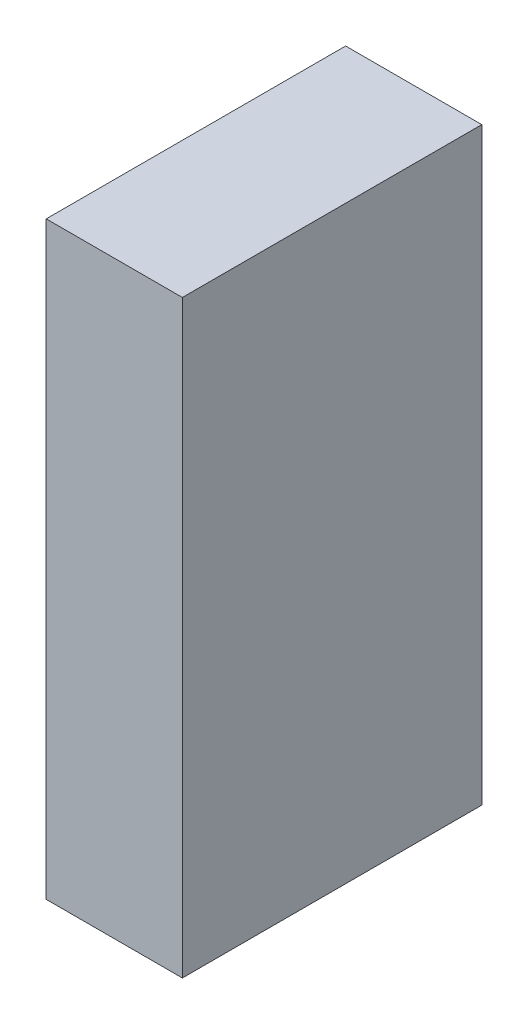
ISO-10303-21;
HEADER;
FILE_DESCRIPTION(('STEP AP214'),'2;1');
FILE_NAME('part.step','',(''),(''),'','','');
FILE_SCHEMA(('AUTOMOTIVE_DESIGN { 1 0 10303 214 1 1 1 1 }'));
ENDSEC;
DATA;
#1=APPLICATION_CONTEXT('core data for automotive mechanical design processes');
#2=APPLICATION_PROTOCOL_DEFINITION('international standard','automotive_design',2000,#1);
#3=PRODUCT_CONTEXT('',#1,'mechanical');
#4=PRODUCT('Part','Part','',(#3));
#5=PRODUCT_RELATED_PRODUCT_CATEGORY('part','',(#4));
#6=PRODUCT_DEFINITION_FORMATION('','',#4);
#7=PRODUCT_DEFINITION_CONTEXT('part definition',#1,'design');
#8=PRODUCT_DEFINITION('design','',#6,#7);
#9=PRODUCT_DEFINITION_SHAPE('','',#8);
#10=(LENGTH_UNIT() NAMED_UNIT(*) SI_UNIT(.MILLI.,.METRE.));
#11=(NAMED_UNIT(*) PLANE_ANGLE_UNIT() SI_UNIT($,.RADIAN.));
#12=(NAMED_UNIT(*) SI_UNIT($,.STERADIAN.) SOLID_ANGLE_UNIT());
#13=UNCERTAINTY_MEASURE_WITH_UNIT(LENGTH_MEASURE(1.E-05),#10,'distance_accuracy_value','');
#14=(GEOMETRIC_REPRESENTATION_CONTEXT(3) GLOBAL_UNCERTAINTY_ASSIGNED_CONTEXT((#13)) GLOBAL_UNIT_ASSIGNED_CONTEXT((#10,
#11,#12)) REPRESENTATION_CONTEXT('',''));
#15=CARTESIAN_POINT('',(0.,0.,0.));
#16=DIRECTION('',(0.,0.,1.));
#17=DIRECTION('',(1.,0.,0.));
#18=AXIS2_PLACEMENT_3D('',#15,#16,#17);
#19=CARTESIAN_POINT('',(-0.11549888,-0.499999,0.508));
#20=DIRECTION('',(0.,0.,1.));
#21=DIRECTION('',(1.,0.,0.));
#22=AXIS2_PLACEMENT_3D('',#19,#20,#21);
#23=PLANE('',#22);
#24=DIRECTION('',(0.,1.,0.));
#25=VECTOR('',#24,1.);
#26=CARTESIAN_POINT('',(-0.11549888,-0.499999,0.508));
#27=LINE('',#26,#25);
#28=CARTESIAN_POINT('',(-0.11549888,-0.499999,0.508));
#29=VERTEX_POINT('',#28);
#30=CARTESIAN_POINT('',(-0.11549888,0.499999,0.508));
#31=VERTEX_POINT('',#30);
#32=EDGE_CURVE('E103',#29,#31,#27,.T.);
#33=ORIENTED_EDGE('',*,*,#32,.F.);
#34=DIRECTION('',(-1.,0.,0.));
#35=VECTOR('',#34,1.);
#36=CARTESIAN_POINT('',(0.11550142,-0.499999,0.508));
#37=LINE('',#36,#35);
#38=CARTESIAN_POINT('',(0.11550142,-0.499999,0.508));
#39=VERTEX_POINT('',#38);
#40=EDGE_CURVE('E27',#39,#29,#37,.T.);
#41=ORIENTED_EDGE('',*,*,#40,.F.);
#42=DIRECTION('',(0.,-1.,0.));
#43=VECTOR('',#42,1.);
#44=CARTESIAN_POINT('',(0.11550142,0.499999,0.508));
#45=LINE('',#44,#43);
#46=CARTESIAN_POINT('',(0.11550142,0.499999,0.508));
#47=VERTEX_POINT('',#46);
#48=EDGE_CURVE('E66',#47,#39,#45,.T.);
#49=ORIENTED_EDGE('',*,*,#48,.F.);
#50=DIRECTION('',(1.,0.,0.));
#51=VECTOR('',#50,1.);
#52=CARTESIAN_POINT('',(-0.11549888,0.499999,0.508));
#53=LINE('',#52,#51);
#54=EDGE_CURVE('E70',#31,#47,#53,.T.);
#55=ORIENTED_EDGE('',*,*,#54,.F.);
#56=EDGE_LOOP('',(#33,#41,#49,#55));
#57=FACE_BOUND('',#56,.T.);
#58=ADVANCED_FACE('F17',(#57),#23,.T.);
#59=CARTESIAN_POINT('',(-0.11549888,-0.499999,0.));
#60=DIRECTION('',(0.,0.,1.));
#61=DIRECTION('',(1.,0.,0.));
#62=AXIS2_PLACEMENT_3D('',#59,#60,#61);
#63=PLANE('',#62);
#64=DIRECTION('',(0.,1.,0.));
#65=VECTOR('',#64,1.);
#66=CARTESIAN_POINT('',(-0.11549888,-0.499999,0.));
#67=LINE('',#66,#65);
#68=CARTESIAN_POINT('',(-0.11549888,-0.499999,0.));
#69=VERTEX_POINT('',#68);
#70=CARTESIAN_POINT('',(-0.11549888,0.499999,0.));
#71=VERTEX_POINT('',#70);
#72=EDGE_CURVE('E90',#69,#71,#67,.T.);
#73=ORIENTED_EDGE('',*,*,#72,.T.);
#74=DIRECTION('',(1.,0.,0.));
#75=VECTOR('',#74,1.);
#76=CARTESIAN_POINT('',(-0.11549888,0.499999,0.));
#77=LINE('',#76,#75);
#78=CARTESIAN_POINT('',(0.11550142,0.499999,0.));
#79=VERTEX_POINT('',#78);
#80=EDGE_CURVE('E75',#71,#79,#77,.T.);
#81=ORIENTED_EDGE('',*,*,#80,.T.);
#82=DIRECTION('',(0.,-1.,0.));
#83=VECTOR('',#82,1.);
#84=CARTESIAN_POINT('',(0.11550142,0.499999,0.));
#85=LINE('',#84,#83);
#86=CARTESIAN_POINT('',(0.11550142,-0.499999,0.));
#87=VERTEX_POINT('',#86);
#88=EDGE_CURVE('E80',#79,#87,#85,.T.);
#89=ORIENTED_EDGE('',*,*,#88,.T.);
#90=DIRECTION('',(-1.,0.,0.));
#91=VECTOR('',#90,1.);
#92=CARTESIAN_POINT('',(0.11550142,-0.499999,0.));
#93=LINE('',#92,#91);
#94=EDGE_CURVE('E11',#87,#69,#93,.T.);
#95=ORIENTED_EDGE('',*,*,#94,.T.);
#96=EDGE_LOOP('',(#73,#81,#89,#95));
#97=FACE_BOUND('',#96,.T.);
#98=ADVANCED_FACE('F119',(#97),#63,.F.);
#99=CARTESIAN_POINT('',(0.11550142,-0.499999,0.));
#100=DIRECTION('',(0.,-1.,0.));
#101=DIRECTION('',(0.,0.,-1.));
#102=AXIS2_PLACEMENT_3D('',#99,#100,#101);
#103=PLANE('',#102);
#104=DIRECTION('',(0.,0.,1.));
#105=VECTOR('',#104,1.);
#106=CARTESIAN_POINT('',(0.11550142,-0.499999,0.));
#107=LINE('',#106,#105);
#108=EDGE_CURVE('E20',#87,#39,#107,.T.);
#109=ORIENTED_EDGE('',*,*,#108,.T.);
#110=ORIENTED_EDGE('',*,*,#40,.T.);
#111=DIRECTION('',(0.,0.,1.));
#112=VECTOR('',#111,1.);
#113=CARTESIAN_POINT('',(-0.11549888,-0.499999,0.));
#114=LINE('',#113,#112);
#115=EDGE_CURVE('E100',#69,#29,#114,.T.);
#116=ORIENTED_EDGE('',*,*,#115,.F.);
#117=ORIENTED_EDGE('',*,*,#94,.F.);
#118=EDGE_LOOP('',(#109,#110,#116,#117));
#119=FACE_BOUND('',#118,.T.);
#120=ADVANCED_FACE('F115',(#119),#103,.T.);
#121=CARTESIAN_POINT('',(0.11550142,0.499999,0.));
#122=DIRECTION('',(1.,0.,0.));
#123=DIRECTION('',(0.,1.,0.));
#124=AXIS2_PLACEMENT_3D('',#121,#122,#123);
#125=PLANE('',#124);
#126=DIRECTION('',(0.,0.,1.));
#127=VECTOR('',#126,1.);
#128=CARTESIAN_POINT('',(0.11550142,0.499999,0.));
#129=LINE('',#128,#127);
#130=EDGE_CURVE('E78',#79,#47,#129,.T.);
#131=ORIENTED_EDGE('',*,*,#130,.T.);
#132=ORIENTED_EDGE('',*,*,#48,.T.);
#133=ORIENTED_EDGE('',*,*,#108,.F.);
#134=ORIENTED_EDGE('',*,*,#88,.F.);
#135=EDGE_LOOP('',(#131,#132,#133,#134));
#136=FACE_BOUND('',#135,.T.);
#137=ADVANCED_FACE('F79',(#136),#125,.T.);
#138=CARTESIAN_POINT('',(-0.11549888,0.499999,0.));
#139=DIRECTION('',(0.,1.,0.));
#140=DIRECTION('',(1.,0.,0.));
#141=AXIS2_PLACEMENT_3D('',#138,#139,#140);
#142=PLANE('',#141);
#143=DIRECTION('',(0.,0.,1.));
#144=VECTOR('',#143,1.);
#145=CARTESIAN_POINT('',(-0.11549888,0.499999,0.));
#146=LINE('',#145,#144);
#147=EDGE_CURVE('E87',#71,#31,#146,.T.);
#148=ORIENTED_EDGE('',*,*,#147,.T.);
#149=ORIENTED_EDGE('',*,*,#54,.T.);
#150=ORIENTED_EDGE('',*,*,#130,.F.);
#151=ORIENTED_EDGE('',*,*,#80,.F.);
#152=EDGE_LOOP('',(#148,#149,#150,#151));
#153=FACE_BOUND('',#152,.T.);
#154=ADVANCED_FACE('F85',(#153),#142,.T.);
#155=CARTESIAN_POINT('',(-0.11549888,-0.499999,0.));
#156=DIRECTION('',(-1.,0.,0.));
#157=DIRECTION('',(0.,0.,1.));
#158=AXIS2_PLACEMENT_3D('',#155,#156,#157);
#159=PLANE('',#158);
#160=ORIENTED_EDGE('',*,*,#115,.T.);
#161=ORIENTED_EDGE('',*,*,#32,.T.);
#162=ORIENTED_EDGE('',*,*,#147,.F.);
#163=ORIENTED_EDGE('',*,*,#72,.F.);
#164=EDGE_LOOP('',(#160,#161,#162,#163));
#165=FACE_BOUND('',#164,.T.);
#166=ADVANCED_FACE('F118',(#165),#159,.T.);
#167=CLOSED_SHELL('',(#58,#98,#120,#137,#154,#166));
#168=MANIFOLD_SOLID_BREP('B1',#167);
#169=ADVANCED_BREP_SHAPE_REPRESENTATION('',(#18,#168),#14);
#170=SHAPE_DEFINITION_REPRESENTATION(#9,#169);
ENDSEC;
END-ISO-10303-21;
